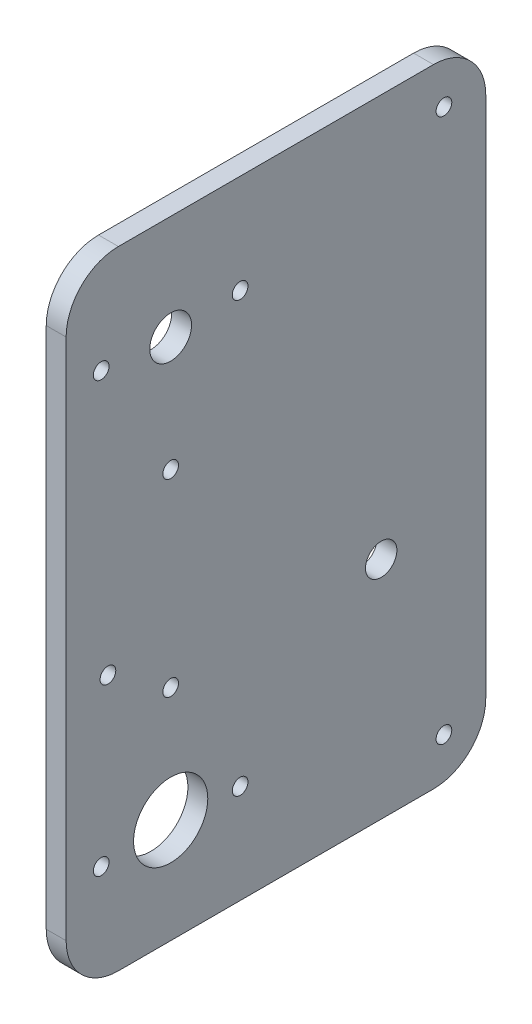
ISO-10303-21;
HEADER;
FILE_DESCRIPTION(('STEP AP214'),'2;1');
FILE_NAME('part.step','',(''),(''),'','','');
FILE_SCHEMA(('AUTOMOTIVE_DESIGN { 1 0 10303 214 1 1 1 1 }'));
ENDSEC;
DATA;
#1=APPLICATION_CONTEXT('core data for automotive mechanical design processes');
#2=APPLICATION_PROTOCOL_DEFINITION('international standard','automotive_design',2000,#1);
#3=PRODUCT_CONTEXT('',#1,'mechanical');
#4=PRODUCT('Part','Part','',(#3));
#5=PRODUCT_RELATED_PRODUCT_CATEGORY('part','',(#4));
#6=PRODUCT_DEFINITION_FORMATION('','',#4);
#7=PRODUCT_DEFINITION_CONTEXT('part definition',#1,'design');
#8=PRODUCT_DEFINITION('design','',#6,#7);
#9=PRODUCT_DEFINITION_SHAPE('','',#8);
#10=(LENGTH_UNIT() NAMED_UNIT(*) SI_UNIT(.MILLI.,.METRE.));
#11=(NAMED_UNIT(*) PLANE_ANGLE_UNIT() SI_UNIT($,.RADIAN.));
#12=(NAMED_UNIT(*) SI_UNIT($,.STERADIAN.) SOLID_ANGLE_UNIT());
#13=UNCERTAINTY_MEASURE_WITH_UNIT(LENGTH_MEASURE(1.E-05),#10,'distance_accuracy_value','');
#14=(GEOMETRIC_REPRESENTATION_CONTEXT(3) GLOBAL_UNCERTAINTY_ASSIGNED_CONTEXT((#13)) GLOBAL_UNIT_ASSIGNED_CONTEXT((#10,
#11,#12)) REPRESENTATION_CONTEXT('',''));
#15=CARTESIAN_POINT('',(0.,0.,0.));
#16=DIRECTION('',(0.,0.,1.));
#17=DIRECTION('',(1.,0.,0.));
#18=AXIS2_PLACEMENT_3D('',#15,#16,#17);
#19=CARTESIAN_POINT('',(3.8,0.,0.));
#20=DIRECTION('',(1.,0.,0.));
#21=DIRECTION('',(0.,0.,-1.));
#22=AXIS2_PLACEMENT_3D('',#19,#20,#21);
#23=PLANE('',#22);
#24=CARTESIAN_POINT('',(3.8,-40.3542302013858,-2.06005210669012));
#25=DIRECTION('',(1.,0.,0.));
#26=DIRECTION('',(0.,0.,-1.));
#27=AXIS2_PLACEMENT_3D('',#24,#25,#26);
#28=CIRCLE('',#27,1.5);
#29=CARTESIAN_POINT('',(3.8,-40.3542302013858,-3.56005210669012));
#30=VERTEX_POINT('',#29);
#31=EDGE_CURVE('E283',#30,#30,#28,.T.);
#32=ORIENTED_EDGE('',*,*,#31,.F.);
#33=EDGE_LOOP('',(#32));
#34=FACE_BOUND('',#33,.T.);
#35=CARTESIAN_POINT('',(3.8,-6.41355568775174,-54.3302275769075));
#36=DIRECTION('',(1.,0.,0.));
#37=DIRECTION('',(0.,0.,1.));
#38=AXIS2_PLACEMENT_3D('',#35,#36,#37);
#39=CIRCLE('',#38,1.5);
#40=CARTESIAN_POINT('',(3.8,-6.41355568775174,-52.8302275769075));
#41=VERTEX_POINT('',#40);
#42=EDGE_CURVE('E267',#41,#41,#39,.T.);
#43=ORIENTED_EDGE('',*,*,#42,.F.);
#44=EDGE_LOOP('',(#43));
#45=FACE_BOUND('',#44,.T.);
#46=CARTESIAN_POINT('',(3.8,-99.4838929205927,11.2253617194627));
#47=DIRECTION('',(1.,0.,0.));
#48=DIRECTION('',(0.,0.,-1.));
#49=AXIS2_PLACEMENT_3D('',#46,#47,#48);
#50=CIRCLE('',#49,1.5);
#51=CARTESIAN_POINT('',(3.8,-99.4838929205927,9.72536171946267));
#52=VERTEX_POINT('',#51);
#53=EDGE_CURVE('E251',#52,#52,#50,.T.);
#54=ORIENTED_EDGE('',*,*,#53,.F.);
#55=EDGE_LOOP('',(#54));
#56=FACE_BOUND('',#55,.T.);
#57=CARTESIAN_POINT('',(3.8,-110.413555687752,-54.3302275769075));
#58=DIRECTION('',(1.,0.,0.));
#59=DIRECTION('',(0.,0.,-1.));
#60=AXIS2_PLACEMENT_3D('',#57,#58,#59);
#61=CIRCLE('',#60,1.5);
#62=CARTESIAN_POINT('',(3.8,-110.413555687752,-55.8302275769075));
#63=VERTEX_POINT('',#62);
#64=EDGE_CURVE('E235',#63,#63,#61,.T.);
#65=ORIENTED_EDGE('',*,*,#64,.F.);
#66=EDGE_LOOP('',(#65));
#67=FACE_BOUND('',#66,.T.);
#68=CARTESIAN_POINT('',(3.8,-75.3641963127518,-42.3302275769075));
#69=DIRECTION('',(1.,0.,0.));
#70=DIRECTION('',(0.,0.,-1.));
#71=AXIS2_PLACEMENT_3D('',#68,#69,#70);
#72=CIRCLE('',#71,3.);
#73=CARTESIAN_POINT('',(3.8,-75.3641963127518,-45.3302275769075));
#74=VERTEX_POINT('',#73);
#75=EDGE_CURVE('E219',#74,#74,#72,.T.);
#76=ORIENTED_EDGE('',*,*,#75,.F.);
#77=EDGE_LOOP('',(#76));
#78=FACE_BOUND('',#77,.T.);
#79=CARTESIAN_POINT('',(3.8,-18.4135556877518,-2.06005210669012));
#80=DIRECTION('',(1.,0.,0.));
#81=DIRECTION('',(0.,0.,-1.));
#82=AXIS2_PLACEMENT_3D('',#79,#80,#81);
#83=CIRCLE('',#82,4.);
#84=CARTESIAN_POINT('',(3.8,-18.4135556877518,-6.06005210669012));
#85=VERTEX_POINT('',#84);
#86=EDGE_CURVE('E137',#85,#85,#83,.T.);
#87=ORIENTED_EDGE('',*,*,#86,.F.);
#88=EDGE_LOOP('',(#87));
#89=FACE_BOUND('',#88,.T.);
#90=DIRECTION('',(0.,0.,1.));
#91=VECTOR('',#90,1.);
#92=CARTESIAN_POINT('',(3.8,1.58644431224824,17.9399478933099));
#93=LINE('',#92,#91);
#94=CARTESIAN_POINT('',(3.8,1.58644431224824,-52.3302275769075));
#95=VERTEX_POINT('',#94);
#96=CARTESIAN_POINT('',(3.8,1.58644431224824,7.93994789330988));
#97=VERTEX_POINT('',#96);
#98=EDGE_CURVE('E148',#95,#97,#93,.T.);
#99=ORIENTED_EDGE('',*,*,#98,.T.);
#100=CARTESIAN_POINT('',(3.8,-8.41355568775175,7.93994789330988));
#101=DIRECTION('',(1.,0.,0.));
#102=DIRECTION('',(0.,0.,-1.));
#103=AXIS2_PLACEMENT_3D('',#100,#101,#102);
#104=CIRCLE('',#103,10.);
#105=CARTESIAN_POINT('',(3.8,-8.41355568775175,17.9399478933099));
#106=VERTEX_POINT('',#105);
#107=EDGE_CURVE('E178',#97,#106,#104,.T.);
#108=ORIENTED_EDGE('',*,*,#107,.T.);
#109=DIRECTION('',(0.,-1.,0.));
#110=VECTOR('',#109,1.);
#111=CARTESIAN_POINT('',(3.8,1.58644431224824,17.9399478933099));
#112=LINE('',#111,#110);
#113=CARTESIAN_POINT('',(3.8,-108.413555687752,17.9399478933099));
#114=VERTEX_POINT('',#113);
#115=EDGE_CURVE('E127',#106,#114,#112,.T.);
#116=ORIENTED_EDGE('',*,*,#115,.T.);
#117=CARTESIAN_POINT('',(3.8,-108.413555687752,7.93994789330987));
#118=DIRECTION('',(1.,0.,0.));
#119=DIRECTION('',(0.,0.,-1.));
#120=AXIS2_PLACEMENT_3D('',#117,#118,#119);
#121=CIRCLE('',#120,10.);
#122=CARTESIAN_POINT('',(3.8,-118.413555687752,7.93994789330987));
#123=VERTEX_POINT('',#122);
#124=EDGE_CURVE('E170',#114,#123,#121,.T.);
#125=ORIENTED_EDGE('',*,*,#124,.T.);
#126=DIRECTION('',(0.,0.,-1.));
#127=VECTOR('',#126,1.);
#128=CARTESIAN_POINT('',(3.8,-118.413555687752,17.9399478933099));
#129=LINE('',#128,#127);
#130=CARTESIAN_POINT('',(3.8,-118.413555687752,-52.3302275769075));
#131=VERTEX_POINT('',#130);
#132=EDGE_CURVE('E193',#123,#131,#129,.T.);
#133=ORIENTED_EDGE('',*,*,#132,.T.);
#134=CARTESIAN_POINT('',(3.8,-108.413555687752,-52.3302275769075));
#135=DIRECTION('',(1.,0.,0.));
#136=DIRECTION('',(0.,0.,-1.));
#137=AXIS2_PLACEMENT_3D('',#134,#135,#136);
#138=CIRCLE('',#137,10.);
#139=CARTESIAN_POINT('',(3.8,-108.413555687752,-62.3302275769075));
#140=VERTEX_POINT('',#139);
#141=EDGE_CURVE('E62',#131,#140,#138,.T.);
#142=ORIENTED_EDGE('',*,*,#141,.T.);
#143=DIRECTION('',(0.,1.,0.));
#144=VECTOR('',#143,1.);
#145=CARTESIAN_POINT('',(3.8,1.58644431224824,-62.3302275769075));
#146=LINE('',#145,#144);
#147=CARTESIAN_POINT('',(3.8,-8.41355568775175,-62.3302275769075));
#148=VERTEX_POINT('',#147);
#149=EDGE_CURVE('E201',#140,#148,#146,.T.);
#150=ORIENTED_EDGE('',*,*,#149,.T.);
#151=CARTESIAN_POINT('',(3.8,-8.41355568775175,-52.3302275769075));
#152=DIRECTION('',(1.,0.,0.));
#153=DIRECTION('',(0.,0.,-1.));
#154=AXIS2_PLACEMENT_3D('',#151,#152,#153);
#155=CIRCLE('',#154,10.);
#156=EDGE_CURVE('E175',#148,#95,#155,.T.);
#157=ORIENTED_EDGE('',*,*,#156,.T.);
#158=EDGE_LOOP('',(#99,#108,#116,#125,#133,#142,#150,#157));
#159=FACE_BOUND('',#158,.T.);
#160=CARTESIAN_POINT('',(3.8,-98.4135556877518,-2.06005210669013));
#161=DIRECTION('',(1.,0.,0.));
#162=DIRECTION('',(0.,0.,-1.));
#163=AXIS2_PLACEMENT_3D('',#160,#161,#162);
#164=CIRCLE('',#163,7.1);
#165=CARTESIAN_POINT('',(3.8,-98.4135556877518,-9.16005210669013));
#166=VERTEX_POINT('',#165);
#167=EDGE_CURVE('E213',#166,#166,#164,.T.);
#168=ORIENTED_EDGE('',*,*,#167,.F.);
#169=EDGE_LOOP('',(#168));
#170=FACE_BOUND('',#169,.T.);
#171=CARTESIAN_POINT('',(3.8,-68.4135556877517,9.93994789330987));
#172=DIRECTION('',(1.,0.,0.));
#173=DIRECTION('',(0.,0.,-1.));
#174=AXIS2_PLACEMENT_3D('',#171,#172,#173);
#175=CIRCLE('',#174,1.5);
#176=CARTESIAN_POINT('',(3.8,-68.4135556877517,8.43994789330987));
#177=VERTEX_POINT('',#176);
#178=EDGE_CURVE('E227',#177,#177,#175,.T.);
#179=ORIENTED_EDGE('',*,*,#178,.F.);
#180=EDGE_LOOP('',(#179));
#181=FACE_BOUND('',#180,.T.);
#182=CARTESIAN_POINT('',(3.8,-76.472881174118,-2.06005210669014));
#183=DIRECTION('',(1.,0.,0.));
#184=DIRECTION('',(0.,0.,-1.));
#185=AXIS2_PLACEMENT_3D('',#182,#183,#184);
#186=CIRCLE('',#185,1.5);
#187=CARTESIAN_POINT('',(3.8,-76.472881174118,-3.56005210669014));
#188=VERTEX_POINT('',#187);
#189=EDGE_CURVE('E243',#188,#188,#186,.T.);
#190=ORIENTED_EDGE('',*,*,#189,.F.);
#191=EDGE_LOOP('',(#190));
#192=FACE_BOUND('',#191,.T.);
#193=CARTESIAN_POINT('',(3.8,-99.4838929205927,-15.3454659328429));
#194=DIRECTION('',(1.,0.,0.));
#195=DIRECTION('',(0.,0.,-1.));
#196=AXIS2_PLACEMENT_3D('',#193,#194,#195);
#197=CIRCLE('',#196,1.5);
#198=CARTESIAN_POINT('',(3.8,-99.4838929205927,-16.8454659328429));
#199=VERTEX_POINT('',#198);
#200=EDGE_CURVE('E259',#199,#199,#197,.T.);
#201=ORIENTED_EDGE('',*,*,#200,.F.);
#202=EDGE_LOOP('',(#201));
#203=FACE_BOUND('',#202,.T.);
#204=CARTESIAN_POINT('',(3.8,-17.3432184549111,-15.3454659328429));
#205=DIRECTION('',(1.,0.,0.));
#206=DIRECTION('',(0.,0.,-1.));
#207=AXIS2_PLACEMENT_3D('',#204,#205,#206);
#208=CIRCLE('',#207,1.5);
#209=CARTESIAN_POINT('',(3.8,-17.3432184549111,-16.8454659328429));
#210=VERTEX_POINT('',#209);
#211=EDGE_CURVE('E275',#210,#210,#208,.T.);
#212=ORIENTED_EDGE('',*,*,#211,.F.);
#213=EDGE_LOOP('',(#212));
#214=FACE_BOUND('',#213,.T.);
#215=CARTESIAN_POINT('',(3.8,-17.3432184549111,11.2253617194627));
#216=DIRECTION('',(1.,0.,0.));
#217=DIRECTION('',(0.,0.,-1.));
#218=AXIS2_PLACEMENT_3D('',#215,#216,#217);
#219=CIRCLE('',#218,1.5);
#220=CARTESIAN_POINT('',(3.8,-17.3432184549111,9.72536171946269));
#221=VERTEX_POINT('',#220);
#222=EDGE_CURVE('E291',#221,#221,#219,.T.);
#223=ORIENTED_EDGE('',*,*,#222,.F.);
#224=EDGE_LOOP('',(#223));
#225=FACE_BOUND('',#224,.T.);
#226=ADVANCED_FACE('F39',(#34,#45,#56,#67,#78,#89,#159,#170,#181,#192,#203,#214,#225),#23,.T.);
#227=CARTESIAN_POINT('',(0.,0.,0.));
#228=DIRECTION('',(1.,0.,0.));
#229=DIRECTION('',(0.,0.,-1.));
#230=AXIS2_PLACEMENT_3D('',#227,#228,#229);
#231=PLANE('',#230);
#232=DIRECTION('',(0.,-1.,0.));
#233=VECTOR('',#232,1.);
#234=CARTESIAN_POINT('',(0.,1.58644431224824,17.9399478933099));
#235=LINE('',#234,#233);
#236=CARTESIAN_POINT('',(0.,-8.41355568775175,17.9399478933099));
#237=VERTEX_POINT('',#236);
#238=CARTESIAN_POINT('',(0.,-108.413555687752,17.9399478933099));
#239=VERTEX_POINT('',#238);
#240=EDGE_CURVE('E124',#237,#239,#235,.T.);
#241=ORIENTED_EDGE('',*,*,#240,.F.);
#242=CARTESIAN_POINT('',(0.,-8.41355568775175,7.93994789330988));
#243=DIRECTION('',(1.,0.,0.));
#244=DIRECTION('',(0.,0.,-1.));
#245=AXIS2_PLACEMENT_3D('',#242,#243,#244);
#246=CIRCLE('',#245,10.);
#247=CARTESIAN_POINT('',(0.,1.58644431224824,7.93994789330988));
#248=VERTEX_POINT('',#247);
#249=EDGE_CURVE('E106',#237,#248,#246,.F.);
#250=ORIENTED_EDGE('',*,*,#249,.T.);
#251=DIRECTION('',(0.,0.,1.));
#252=VECTOR('',#251,1.);
#253=CARTESIAN_POINT('',(0.,1.58644431224824,17.9399478933099));
#254=LINE('',#253,#252);
#255=CARTESIAN_POINT('',(0.,1.58644431224824,-52.3302275769075));
#256=VERTEX_POINT('',#255);
#257=EDGE_CURVE('E153',#256,#248,#254,.T.);
#258=ORIENTED_EDGE('',*,*,#257,.F.);
#259=CARTESIAN_POINT('',(0.,-8.41355568775175,-52.3302275769075));
#260=DIRECTION('',(1.,0.,0.));
#261=DIRECTION('',(0.,0.,-1.));
#262=AXIS2_PLACEMENT_3D('',#259,#260,#261);
#263=CIRCLE('',#262,10.);
#264=CARTESIAN_POINT('',(0.,-8.41355568775175,-62.3302275769075));
#265=VERTEX_POINT('',#264);
#266=EDGE_CURVE('E118',#256,#265,#263,.F.);
#267=ORIENTED_EDGE('',*,*,#266,.T.);
#268=DIRECTION('',(0.,1.,0.));
#269=VECTOR('',#268,1.);
#270=CARTESIAN_POINT('',(0.,1.58644431224824,-62.3302275769075));
#271=LINE('',#270,#269);
#272=CARTESIAN_POINT('',(0.,-108.413555687752,-62.3302275769075));
#273=VERTEX_POINT('',#272);
#274=EDGE_CURVE('E142',#273,#265,#271,.T.);
#275=ORIENTED_EDGE('',*,*,#274,.F.);
#276=CARTESIAN_POINT('',(0.,-108.413555687752,-52.3302275769075));
#277=DIRECTION('',(1.,0.,0.));
#278=DIRECTION('',(0.,0.,-1.));
#279=AXIS2_PLACEMENT_3D('',#276,#277,#278);
#280=CIRCLE('',#279,10.);
#281=CARTESIAN_POINT('',(0.,-118.413555687752,-52.3302275769075));
#282=VERTEX_POINT('',#281);
#283=EDGE_CURVE('E160',#273,#282,#280,.F.);
#284=ORIENTED_EDGE('',*,*,#283,.T.);
#285=DIRECTION('',(0.,0.,-1.));
#286=VECTOR('',#285,1.);
#287=CARTESIAN_POINT('',(0.,-118.413555687752,17.9399478933099));
#288=LINE('',#287,#286);
#289=CARTESIAN_POINT('',(0.,-118.413555687752,7.93994789330987));
#290=VERTEX_POINT('',#289);
#291=EDGE_CURVE('E136',#290,#282,#288,.T.);
#292=ORIENTED_EDGE('',*,*,#291,.F.);
#293=CARTESIAN_POINT('',(0.,-108.413555687752,7.93994789330987));
#294=DIRECTION('',(1.,0.,0.));
#295=DIRECTION('',(0.,0.,-1.));
#296=AXIS2_PLACEMENT_3D('',#293,#294,#295);
#297=CIRCLE('',#296,10.);
#298=EDGE_CURVE('E129',#290,#239,#297,.F.);
#299=ORIENTED_EDGE('',*,*,#298,.T.);
#300=EDGE_LOOP('',(#241,#250,#258,#267,#275,#284,#292,#299));
#301=FACE_BOUND('',#300,.T.);
#302=CARTESIAN_POINT('',(0.,-18.4135556877518,-2.06005210669012));
#303=DIRECTION('',(1.,0.,0.));
#304=DIRECTION('',(0.,0.,-1.));
#305=AXIS2_PLACEMENT_3D('',#302,#303,#304);
#306=CIRCLE('',#305,4.);
#307=CARTESIAN_POINT('',(0.,-18.4135556877518,-6.06005210669012));
#308=VERTEX_POINT('',#307);
#309=EDGE_CURVE('E145',#308,#308,#306,.T.);
#310=ORIENTED_EDGE('',*,*,#309,.T.);
#311=EDGE_LOOP('',(#310));
#312=FACE_BOUND('',#311,.T.);
#313=CARTESIAN_POINT('',(0.,-98.4135556877518,-2.06005210669013));
#314=DIRECTION('',(1.,0.,0.));
#315=DIRECTION('',(0.,0.,-1.));
#316=AXIS2_PLACEMENT_3D('',#313,#314,#315);
#317=CIRCLE('',#316,7.1);
#318=CARTESIAN_POINT('',(0.,-98.4135556877518,-9.16005210669013));
#319=VERTEX_POINT('',#318);
#320=EDGE_CURVE('E215',#319,#319,#317,.T.);
#321=ORIENTED_EDGE('',*,*,#320,.T.);
#322=EDGE_LOOP('',(#321));
#323=FACE_BOUND('',#322,.T.);
#324=CARTESIAN_POINT('',(0.,-75.3641963127518,-42.3302275769075));
#325=DIRECTION('',(1.,0.,0.));
#326=DIRECTION('',(0.,0.,-1.));
#327=AXIS2_PLACEMENT_3D('',#324,#325,#326);
#328=CIRCLE('',#327,3.);
#329=CARTESIAN_POINT('',(0.,-75.3641963127518,-45.3302275769075));
#330=VERTEX_POINT('',#329);
#331=EDGE_CURVE('E223',#330,#330,#328,.T.);
#332=ORIENTED_EDGE('',*,*,#331,.T.);
#333=EDGE_LOOP('',(#332));
#334=FACE_BOUND('',#333,.T.);
#335=CARTESIAN_POINT('',(0.,-68.4135556877517,9.93994789330987));
#336=DIRECTION('',(1.,0.,0.));
#337=DIRECTION('',(0.,0.,-1.));
#338=AXIS2_PLACEMENT_3D('',#335,#336,#337);
#339=CIRCLE('',#338,1.5);
#340=CARTESIAN_POINT('',(0.,-68.4135556877517,8.43994789330987));
#341=VERTEX_POINT('',#340);
#342=EDGE_CURVE('E231',#341,#341,#339,.T.);
#343=ORIENTED_EDGE('',*,*,#342,.T.);
#344=EDGE_LOOP('',(#343));
#345=FACE_BOUND('',#344,.T.);
#346=CARTESIAN_POINT('',(0.,-110.413555687752,-54.3302275769075));
#347=DIRECTION('',(1.,0.,0.));
#348=DIRECTION('',(0.,0.,-1.));
#349=AXIS2_PLACEMENT_3D('',#346,#347,#348);
#350=CIRCLE('',#349,1.5);
#351=CARTESIAN_POINT('',(0.,-110.413555687752,-55.8302275769075));
#352=VERTEX_POINT('',#351);
#353=EDGE_CURVE('E239',#352,#352,#350,.T.);
#354=ORIENTED_EDGE('',*,*,#353,.T.);
#355=EDGE_LOOP('',(#354));
#356=FACE_BOUND('',#355,.T.);
#357=CARTESIAN_POINT('',(0.,-76.472881174118,-2.06005210669014));
#358=DIRECTION('',(1.,0.,0.));
#359=DIRECTION('',(0.,0.,-1.));
#360=AXIS2_PLACEMENT_3D('',#357,#358,#359);
#361=CIRCLE('',#360,1.5);
#362=CARTESIAN_POINT('',(0.,-76.472881174118,-3.56005210669014));
#363=VERTEX_POINT('',#362);
#364=EDGE_CURVE('E247',#363,#363,#361,.T.);
#365=ORIENTED_EDGE('',*,*,#364,.T.);
#366=EDGE_LOOP('',(#365));
#367=FACE_BOUND('',#366,.T.);
#368=CARTESIAN_POINT('',(0.,-99.4838929205927,11.2253617194627));
#369=DIRECTION('',(1.,0.,0.));
#370=DIRECTION('',(0.,0.,-1.));
#371=AXIS2_PLACEMENT_3D('',#368,#369,#370);
#372=CIRCLE('',#371,1.5);
#373=CARTESIAN_POINT('',(0.,-99.4838929205927,9.72536171946267));
#374=VERTEX_POINT('',#373);
#375=EDGE_CURVE('E255',#374,#374,#372,.T.);
#376=ORIENTED_EDGE('',*,*,#375,.T.);
#377=EDGE_LOOP('',(#376));
#378=FACE_BOUND('',#377,.T.);
#379=CARTESIAN_POINT('',(0.,-99.4838929205927,-15.3454659328429));
#380=DIRECTION('',(1.,0.,0.));
#381=DIRECTION('',(0.,0.,-1.));
#382=AXIS2_PLACEMENT_3D('',#379,#380,#381);
#383=CIRCLE('',#382,1.5);
#384=CARTESIAN_POINT('',(0.,-99.4838929205927,-16.8454659328429));
#385=VERTEX_POINT('',#384);
#386=EDGE_CURVE('E263',#385,#385,#383,.T.);
#387=ORIENTED_EDGE('',*,*,#386,.T.);
#388=EDGE_LOOP('',(#387));
#389=FACE_BOUND('',#388,.T.);
#390=CARTESIAN_POINT('',(0.,-6.41355568775174,-54.3302275769075));
#391=DIRECTION('',(1.,0.,0.));
#392=DIRECTION('',(0.,0.,1.));
#393=AXIS2_PLACEMENT_3D('',#390,#391,#392);
#394=CIRCLE('',#393,1.5);
#395=CARTESIAN_POINT('',(0.,-6.41355568775174,-52.8302275769075));
#396=VERTEX_POINT('',#395);
#397=EDGE_CURVE('E271',#396,#396,#394,.T.);
#398=ORIENTED_EDGE('',*,*,#397,.T.);
#399=EDGE_LOOP('',(#398));
#400=FACE_BOUND('',#399,.T.);
#401=CARTESIAN_POINT('',(0.,-17.3432184549111,-15.3454659328429));
#402=DIRECTION('',(1.,0.,0.));
#403=DIRECTION('',(0.,0.,-1.));
#404=AXIS2_PLACEMENT_3D('',#401,#402,#403);
#405=CIRCLE('',#404,1.5);
#406=CARTESIAN_POINT('',(0.,-17.3432184549111,-16.8454659328429));
#407=VERTEX_POINT('',#406);
#408=EDGE_CURVE('E279',#407,#407,#405,.T.);
#409=ORIENTED_EDGE('',*,*,#408,.T.);
#410=EDGE_LOOP('',(#409));
#411=FACE_BOUND('',#410,.T.);
#412=CARTESIAN_POINT('',(0.,-40.3542302013858,-2.06005210669012));
#413=DIRECTION('',(1.,0.,0.));
#414=DIRECTION('',(0.,0.,-1.));
#415=AXIS2_PLACEMENT_3D('',#412,#413,#414);
#416=CIRCLE('',#415,1.5);
#417=CARTESIAN_POINT('',(0.,-40.3542302013858,-3.56005210669012));
#418=VERTEX_POINT('',#417);
#419=EDGE_CURVE('E287',#418,#418,#416,.T.);
#420=ORIENTED_EDGE('',*,*,#419,.T.);
#421=EDGE_LOOP('',(#420));
#422=FACE_BOUND('',#421,.T.);
#423=CARTESIAN_POINT('',(0.,-17.3432184549111,11.2253617194627));
#424=DIRECTION('',(1.,0.,0.));
#425=DIRECTION('',(0.,0.,-1.));
#426=AXIS2_PLACEMENT_3D('',#423,#424,#425);
#427=CIRCLE('',#426,1.5);
#428=CARTESIAN_POINT('',(0.,-17.3432184549111,9.72536171946269));
#429=VERTEX_POINT('',#428);
#430=EDGE_CURVE('E295',#429,#429,#427,.T.);
#431=ORIENTED_EDGE('',*,*,#430,.T.);
#432=EDGE_LOOP('',(#431));
#433=FACE_BOUND('',#432,.T.);
#434=ADVANCED_FACE('F132',(#301,#312,#323,#334,#345,#356,#367,#378,#389,#400,#411,#422,#433),
#231,.F.);
#435=CARTESIAN_POINT('',(3.8,1.58644431224824,17.9399478933099));
#436=DIRECTION('',(0.,0.,-1.));
#437=DIRECTION('',(0.,1.,0.));
#438=AXIS2_PLACEMENT_3D('',#435,#436,#437);
#439=PLANE('',#438);
#440=ORIENTED_EDGE('',*,*,#115,.F.);
#441=DIRECTION('',(-1.,0.,0.));
#442=VECTOR('',#441,1.);
#443=CARTESIAN_POINT('',(3.8,-8.41355568775176,17.9399478933099));
#444=LINE('',#443,#442);
#445=EDGE_CURVE('E110',#106,#237,#444,.T.);
#446=ORIENTED_EDGE('',*,*,#445,.T.);
#447=ORIENTED_EDGE('',*,*,#240,.T.);
#448=DIRECTION('',(-1.,0.,0.));
#449=VECTOR('',#448,1.);
#450=CARTESIAN_POINT('',(3.8,-108.413555687752,17.9399478933099));
#451=LINE('',#450,#449);
#452=EDGE_CURVE('E130',#239,#114,#451,.F.);
#453=ORIENTED_EDGE('',*,*,#452,.T.);
#454=EDGE_LOOP('',(#440,#446,#447,#453));
#455=FACE_BOUND('',#454,.T.);
#456=ADVANCED_FACE('F123',(#455),#439,.F.);
#457=CARTESIAN_POINT('',(3.8,-118.413555687752,17.9399478933099));
#458=DIRECTION('',(0.,1.,0.));
#459=DIRECTION('',(0.,0.,1.));
#460=AXIS2_PLACEMENT_3D('',#457,#458,#459);
#461=PLANE('',#460);
#462=ORIENTED_EDGE('',*,*,#291,.T.);
#463=DIRECTION('',(-1.,0.,0.));
#464=VECTOR('',#463,1.);
#465=CARTESIAN_POINT('',(3.8,-118.413555687752,-52.3302275769075));
#466=LINE('',#465,#464);
#467=EDGE_CURVE('E11',#282,#131,#466,.F.);
#468=ORIENTED_EDGE('',*,*,#467,.T.);
#469=ORIENTED_EDGE('',*,*,#132,.F.);
#470=DIRECTION('',(-1.,0.,0.));
#471=VECTOR('',#470,1.);
#472=CARTESIAN_POINT('',(3.8,-118.413555687752,7.93994789330987));
#473=LINE('',#472,#471);
#474=EDGE_CURVE('E48',#123,#290,#473,.T.);
#475=ORIENTED_EDGE('',*,*,#474,.T.);
#476=EDGE_LOOP('',(#462,#468,#469,#475));
#477=FACE_BOUND('',#476,.T.);
#478=ADVANCED_FACE('F191',(#477),#461,.F.);
#479=CARTESIAN_POINT('',(3.8,1.58644431224824,-62.3302275769075));
#480=DIRECTION('',(0.,0.,1.));
#481=DIRECTION('',(0.,-1.,0.));
#482=AXIS2_PLACEMENT_3D('',#479,#480,#481);
#483=PLANE('',#482);
#484=ORIENTED_EDGE('',*,*,#274,.T.);
#485=DIRECTION('',(-1.,0.,0.));
#486=VECTOR('',#485,1.);
#487=CARTESIAN_POINT('',(3.8,-8.41355568775175,-62.3302275769075));
#488=LINE('',#487,#486);
#489=EDGE_CURVE('E55',#265,#148,#488,.F.);
#490=ORIENTED_EDGE('',*,*,#489,.T.);
#491=ORIENTED_EDGE('',*,*,#149,.F.);
#492=DIRECTION('',(-1.,0.,0.));
#493=VECTOR('',#492,1.);
#494=CARTESIAN_POINT('',(3.8,-108.413555687752,-62.3302275769075));
#495=LINE('',#494,#493);
#496=EDGE_CURVE('E181',#140,#273,#495,.T.);
#497=ORIENTED_EDGE('',*,*,#496,.T.);
#498=EDGE_LOOP('',(#484,#490,#491,#497));
#499=FACE_BOUND('',#498,.T.);
#500=ADVANCED_FACE('F200',(#499),#483,.F.);
#501=CARTESIAN_POINT('',(3.8,1.58644431224824,17.9399478933099));
#502=DIRECTION('',(0.,-1.,0.));
#503=DIRECTION('',(0.,0.,-1.));
#504=AXIS2_PLACEMENT_3D('',#501,#502,#503);
#505=PLANE('',#504);
#506=ORIENTED_EDGE('',*,*,#257,.T.);
#507=DIRECTION('',(-1.,0.,0.));
#508=VECTOR('',#507,1.);
#509=CARTESIAN_POINT('',(3.8,1.58644431224824,7.93994789330988));
#510=LINE('',#509,#508);
#511=EDGE_CURVE('E111',#248,#97,#510,.F.);
#512=ORIENTED_EDGE('',*,*,#511,.T.);
#513=ORIENTED_EDGE('',*,*,#98,.F.);
#514=DIRECTION('',(-1.,0.,0.));
#515=VECTOR('',#514,1.);
#516=CARTESIAN_POINT('',(3.8,1.58644431224824,-52.3302275769075));
#517=LINE('',#516,#515);
#518=EDGE_CURVE('E117',#95,#256,#517,.T.);
#519=ORIENTED_EDGE('',*,*,#518,.T.);
#520=EDGE_LOOP('',(#506,#512,#513,#519));
#521=FACE_BOUND('',#520,.T.);
#522=ADVANCED_FACE('F319',(#521),#505,.F.);
#523=CARTESIAN_POINT('',(3.8,-18.4135556877518,-2.06005210669012));
#524=DIRECTION('',(-1.,0.,0.));
#525=DIRECTION('',(0.,0.,1.));
#526=AXIS2_PLACEMENT_3D('',#523,#524,#525);
#527=CYLINDRICAL_SURFACE('',#526,4.);
#528=ORIENTED_EDGE('',*,*,#86,.T.);
#529=EDGE_LOOP('',(#528));
#530=FACE_BOUND('',#529,.T.);
#531=ORIENTED_EDGE('',*,*,#309,.F.);
#532=EDGE_LOOP('',(#531));
#533=FACE_BOUND('',#532,.T.);
#534=ADVANCED_FACE('F316',(#530,#533),#527,.F.);
#535=CARTESIAN_POINT('',(3.8,-98.4135556877518,-2.06005210669013));
#536=DIRECTION('',(-1.,0.,0.));
#537=DIRECTION('',(0.,0.,1.));
#538=AXIS2_PLACEMENT_3D('',#535,#536,#537);
#539=CYLINDRICAL_SURFACE('',#538,7.1);
#540=ORIENTED_EDGE('',*,*,#167,.T.);
#541=EDGE_LOOP('',(#540));
#542=FACE_BOUND('',#541,.T.);
#543=ORIENTED_EDGE('',*,*,#320,.F.);
#544=EDGE_LOOP('',(#543));
#545=FACE_BOUND('',#544,.T.);
#546=ADVANCED_FACE('F398',(#542,#545),#539,.F.);
#547=CARTESIAN_POINT('',(3.8,-75.3641963127518,-42.3302275769075));
#548=DIRECTION('',(-1.,0.,0.));
#549=DIRECTION('',(0.,0.,1.));
#550=AXIS2_PLACEMENT_3D('',#547,#548,#549);
#551=CYLINDRICAL_SURFACE('',#550,3.);
#552=ORIENTED_EDGE('',*,*,#75,.T.);
#553=EDGE_LOOP('',(#552));
#554=FACE_BOUND('',#553,.T.);
#555=ORIENTED_EDGE('',*,*,#331,.F.);
#556=EDGE_LOOP('',(#555));
#557=FACE_BOUND('',#556,.T.);
#558=ADVANCED_FACE('F395',(#554,#557),#551,.F.);
#559=CARTESIAN_POINT('',(3.8,-68.4135556877517,9.93994789330987));
#560=DIRECTION('',(-1.,0.,0.));
#561=DIRECTION('',(0.,0.,1.));
#562=AXIS2_PLACEMENT_3D('',#559,#560,#561);
#563=CYLINDRICAL_SURFACE('',#562,1.5);
#564=ORIENTED_EDGE('',*,*,#178,.T.);
#565=EDGE_LOOP('',(#564));
#566=FACE_BOUND('',#565,.T.);
#567=ORIENTED_EDGE('',*,*,#342,.F.);
#568=EDGE_LOOP('',(#567));
#569=FACE_BOUND('',#568,.T.);
#570=ADVANCED_FACE('F391',(#566,#569),#563,.F.);
#571=CARTESIAN_POINT('',(3.8,-110.413555687752,-54.3302275769075));
#572=DIRECTION('',(-1.,0.,0.));
#573=DIRECTION('',(0.,0.,1.));
#574=AXIS2_PLACEMENT_3D('',#571,#572,#573);
#575=CYLINDRICAL_SURFACE('',#574,1.5);
#576=ORIENTED_EDGE('',*,*,#64,.T.);
#577=EDGE_LOOP('',(#576));
#578=FACE_BOUND('',#577,.T.);
#579=ORIENTED_EDGE('',*,*,#353,.F.);
#580=EDGE_LOOP('',(#579));
#581=FACE_BOUND('',#580,.T.);
#582=ADVANCED_FACE('F387',(#578,#581),#575,.F.);
#583=CARTESIAN_POINT('',(3.8,-76.472881174118,-2.06005210669014));
#584=DIRECTION('',(-1.,0.,0.));
#585=DIRECTION('',(0.,0.,1.));
#586=AXIS2_PLACEMENT_3D('',#583,#584,#585);
#587=CYLINDRICAL_SURFACE('',#586,1.5);
#588=ORIENTED_EDGE('',*,*,#189,.T.);
#589=EDGE_LOOP('',(#588));
#590=FACE_BOUND('',#589,.T.);
#591=ORIENTED_EDGE('',*,*,#364,.F.);
#592=EDGE_LOOP('',(#591));
#593=FACE_BOUND('',#592,.T.);
#594=ADVANCED_FACE('F383',(#590,#593),#587,.F.);
#595=CARTESIAN_POINT('',(3.8,-99.4838929205927,11.2253617194627));
#596=DIRECTION('',(-1.,0.,0.));
#597=DIRECTION('',(0.,0.,1.));
#598=AXIS2_PLACEMENT_3D('',#595,#596,#597);
#599=CYLINDRICAL_SURFACE('',#598,1.5);
#600=ORIENTED_EDGE('',*,*,#53,.T.);
#601=EDGE_LOOP('',(#600));
#602=FACE_BOUND('',#601,.T.);
#603=ORIENTED_EDGE('',*,*,#375,.F.);
#604=EDGE_LOOP('',(#603));
#605=FACE_BOUND('',#604,.T.);
#606=ADVANCED_FACE('F379',(#602,#605),#599,.F.);
#607=CARTESIAN_POINT('',(3.8,-99.4838929205927,-15.3454659328429));
#608=DIRECTION('',(-1.,0.,0.));
#609=DIRECTION('',(0.,0.,1.));
#610=AXIS2_PLACEMENT_3D('',#607,#608,#609);
#611=CYLINDRICAL_SURFACE('',#610,1.5);
#612=ORIENTED_EDGE('',*,*,#200,.T.);
#613=EDGE_LOOP('',(#612));
#614=FACE_BOUND('',#613,.T.);
#615=ORIENTED_EDGE('',*,*,#386,.F.);
#616=EDGE_LOOP('',(#615));
#617=FACE_BOUND('',#616,.T.);
#618=ADVANCED_FACE('F375',(#614,#617),#611,.F.);
#619=CARTESIAN_POINT('',(3.8,-6.41355568775174,-54.3302275769075));
#620=DIRECTION('',(-1.,0.,0.));
#621=DIRECTION('',(0.,0.,1.));
#622=AXIS2_PLACEMENT_3D('',#619,#620,#621);
#623=CYLINDRICAL_SURFACE('',#622,1.5);
#624=ORIENTED_EDGE('',*,*,#42,.T.);
#625=EDGE_LOOP('',(#624));
#626=FACE_BOUND('',#625,.T.);
#627=ORIENTED_EDGE('',*,*,#397,.F.);
#628=EDGE_LOOP('',(#627));
#629=FACE_BOUND('',#628,.T.);
#630=ADVANCED_FACE('F357',(#626,#629),#623,.F.);
#631=CARTESIAN_POINT('',(3.8,-17.3432184549111,-15.3454659328429));
#632=DIRECTION('',(-1.,0.,0.));
#633=DIRECTION('',(0.,0.,1.));
#634=AXIS2_PLACEMENT_3D('',#631,#632,#633);
#635=CYLINDRICAL_SURFACE('',#634,1.5);
#636=ORIENTED_EDGE('',*,*,#211,.T.);
#637=EDGE_LOOP('',(#636));
#638=FACE_BOUND('',#637,.T.);
#639=ORIENTED_EDGE('',*,*,#408,.F.);
#640=EDGE_LOOP('',(#639));
#641=FACE_BOUND('',#640,.T.);
#642=ADVANCED_FACE('F353',(#638,#641),#635,.F.);
#643=CARTESIAN_POINT('',(3.8,-40.3542302013858,-2.06005210669012));
#644=DIRECTION('',(-1.,0.,0.));
#645=DIRECTION('',(0.,0.,1.));
#646=AXIS2_PLACEMENT_3D('',#643,#644,#645);
#647=CYLINDRICAL_SURFACE('',#646,1.5);
#648=ORIENTED_EDGE('',*,*,#31,.T.);
#649=EDGE_LOOP('',(#648));
#650=FACE_BOUND('',#649,.T.);
#651=ORIENTED_EDGE('',*,*,#419,.F.);
#652=EDGE_LOOP('',(#651));
#653=FACE_BOUND('',#652,.T.);
#654=ADVANCED_FACE('F356',(#650,#653),#647,.F.);
#655=CARTESIAN_POINT('',(3.8,-17.3432184549111,11.2253617194627));
#656=DIRECTION('',(-1.,0.,0.));
#657=DIRECTION('',(0.,0.,1.));
#658=AXIS2_PLACEMENT_3D('',#655,#656,#657);
#659=CYLINDRICAL_SURFACE('',#658,1.5);
#660=ORIENTED_EDGE('',*,*,#222,.T.);
#661=EDGE_LOOP('',(#660));
#662=FACE_BOUND('',#661,.T.);
#663=ORIENTED_EDGE('',*,*,#430,.F.);
#664=EDGE_LOOP('',(#663));
#665=FACE_BOUND('',#664,.T.);
#666=ADVANCED_FACE('F303',(#662,#665),#659,.F.);
#667=CARTESIAN_POINT('',(3.8,-8.41355568775175,7.93994789330988));
#668=DIRECTION('',(-1.,0.,0.));
#669=DIRECTION('',(0.,0.,1.));
#670=AXIS2_PLACEMENT_3D('',#667,#668,#669);
#671=CYLINDRICAL_SURFACE('',#670,10.);
#672=ORIENTED_EDGE('',*,*,#107,.F.);
#673=ORIENTED_EDGE('',*,*,#511,.F.);
#674=ORIENTED_EDGE('',*,*,#249,.F.);
#675=ORIENTED_EDGE('',*,*,#445,.F.);
#676=EDGE_LOOP('',(#672,#673,#674,#675));
#677=FACE_BOUND('',#676,.T.);
#678=ADVANCED_FACE('F109',(#677),#671,.T.);
#679=CARTESIAN_POINT('',(3.8,-8.41355568775175,-52.3302275769075));
#680=DIRECTION('',(-1.,0.,0.));
#681=DIRECTION('',(0.,0.,1.));
#682=AXIS2_PLACEMENT_3D('',#679,#680,#681);
#683=CYLINDRICAL_SURFACE('',#682,10.);
#684=ORIENTED_EDGE('',*,*,#156,.F.);
#685=ORIENTED_EDGE('',*,*,#489,.F.);
#686=ORIENTED_EDGE('',*,*,#266,.F.);
#687=ORIENTED_EDGE('',*,*,#518,.F.);
#688=EDGE_LOOP('',(#684,#685,#686,#687));
#689=FACE_BOUND('',#688,.T.);
#690=ADVANCED_FACE('F331',(#689),#683,.T.);
#691=CARTESIAN_POINT('',(3.8,-108.413555687752,-52.3302275769075));
#692=DIRECTION('',(-1.,0.,0.));
#693=DIRECTION('',(0.,0.,1.));
#694=AXIS2_PLACEMENT_3D('',#691,#692,#693);
#695=CYLINDRICAL_SURFACE('',#694,10.);
#696=ORIENTED_EDGE('',*,*,#141,.F.);
#697=ORIENTED_EDGE('',*,*,#467,.F.);
#698=ORIENTED_EDGE('',*,*,#283,.F.);
#699=ORIENTED_EDGE('',*,*,#496,.F.);
#700=EDGE_LOOP('',(#696,#697,#698,#699));
#701=FACE_BOUND('',#700,.T.);
#702=ADVANCED_FACE('F199',(#701),#695,.T.);
#703=CARTESIAN_POINT('',(3.8,-108.413555687752,7.93994789330987));
#704=DIRECTION('',(-1.,0.,0.));
#705=DIRECTION('',(0.,0.,1.));
#706=AXIS2_PLACEMENT_3D('',#703,#704,#705);
#707=CYLINDRICAL_SURFACE('',#706,10.);
#708=ORIENTED_EDGE('',*,*,#124,.F.);
#709=ORIENTED_EDGE('',*,*,#452,.F.);
#710=ORIENTED_EDGE('',*,*,#298,.F.);
#711=ORIENTED_EDGE('',*,*,#474,.F.);
#712=EDGE_LOOP('',(#708,#709,#710,#711));
#713=FACE_BOUND('',#712,.T.);
#714=ADVANCED_FACE('F41',(#713),#707,.T.);
#715=CLOSED_SHELL('',(#226,#434,#456,#478,#500,#522,#534,#546,#558,#570,#582,#594,#606,#618,
#630,#642,#654,#666,#678,#690,#702,#714));
#716=MANIFOLD_SOLID_BREP('B2',#715);
#717=ADVANCED_BREP_SHAPE_REPRESENTATION('',(#18,#716),#14);
#718=SHAPE_DEFINITION_REPRESENTATION(#9,#717);
ENDSEC;
END-ISO-10303-21;
